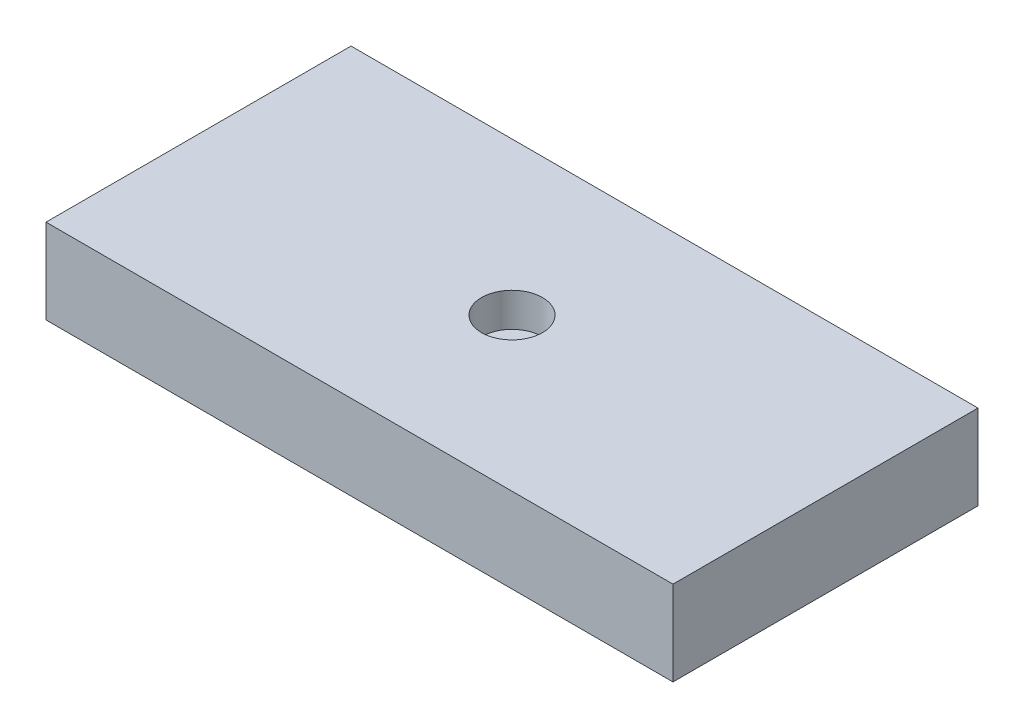
ISO-10303-21;
HEADER;
FILE_DESCRIPTION(('STEP AP214'),'2;1');
FILE_NAME('part.step','',(''),(''),'','','');
FILE_SCHEMA(('AUTOMOTIVE_DESIGN { 1 0 10303 214 1 1 1 1 }'));
ENDSEC;
DATA;
#1=APPLICATION_CONTEXT('core data for automotive mechanical design processes');
#2=APPLICATION_PROTOCOL_DEFINITION('international standard','automotive_design',2000,#1);
#3=PRODUCT_CONTEXT('',#1,'mechanical');
#4=PRODUCT('Part','Part','',(#3));
#5=PRODUCT_RELATED_PRODUCT_CATEGORY('part','',(#4));
#6=PRODUCT_DEFINITION_FORMATION('','',#4);
#7=PRODUCT_DEFINITION_CONTEXT('part definition',#1,'design');
#8=PRODUCT_DEFINITION('design','',#6,#7);
#9=PRODUCT_DEFINITION_SHAPE('','',#8);
#10=(LENGTH_UNIT() NAMED_UNIT(*) SI_UNIT(.MILLI.,.METRE.));
#11=(NAMED_UNIT(*) PLANE_ANGLE_UNIT() SI_UNIT($,.RADIAN.));
#12=(NAMED_UNIT(*) SI_UNIT($,.STERADIAN.) SOLID_ANGLE_UNIT());
#13=UNCERTAINTY_MEASURE_WITH_UNIT(LENGTH_MEASURE(1.E-05),#10,'distance_accuracy_value','');
#14=(GEOMETRIC_REPRESENTATION_CONTEXT(3) GLOBAL_UNCERTAINTY_ASSIGNED_CONTEXT((#13)) GLOBAL_UNIT_ASSIGNED_CONTEXT((#10,
#11,#12)) REPRESENTATION_CONTEXT('',''));
#15=CARTESIAN_POINT('',(0.,0.,0.));
#16=DIRECTION('',(0.,0.,1.));
#17=DIRECTION('',(1.,0.,0.));
#18=AXIS2_PLACEMENT_3D('',#15,#16,#17);
#19=CARTESIAN_POINT('',(18.5,5.,9.));
#20=DIRECTION('',(-1.,0.,0.));
#21=DIRECTION('',(0.,0.,1.));
#22=AXIS2_PLACEMENT_3D('',#19,#20,#21);
#23=PLANE('',#22);
#24=DIRECTION('',(0.,0.,-1.));
#25=VECTOR('',#24,1.);
#26=CARTESIAN_POINT('',(18.5,0.,9.));
#27=LINE('',#26,#25);
#28=CARTESIAN_POINT('',(18.5,0.,9.));
#29=VERTEX_POINT('',#28);
#30=CARTESIAN_POINT('',(18.5,0.,-9.));
#31=VERTEX_POINT('',#30);
#32=EDGE_CURVE('E96',#29,#31,#27,.T.);
#33=ORIENTED_EDGE('',*,*,#32,.T.);
#34=DIRECTION('',(0.,-1.,0.));
#35=VECTOR('',#34,1.);
#36=CARTESIAN_POINT('',(18.5,5.,-9.));
#37=LINE('',#36,#35);
#38=CARTESIAN_POINT('',(18.5,5.,-9.));
#39=VERTEX_POINT('',#38);
#40=EDGE_CURVE('E11',#39,#31,#37,.T.);
#41=ORIENTED_EDGE('',*,*,#40,.F.);
#42=DIRECTION('',(0.,0.,-1.));
#43=VECTOR('',#42,1.);
#44=CARTESIAN_POINT('',(18.5,5.,9.));
#45=LINE('',#44,#43);
#46=CARTESIAN_POINT('',(18.5,5.,9.));
#47=VERTEX_POINT('',#46);
#48=EDGE_CURVE('E84',#47,#39,#45,.T.);
#49=ORIENTED_EDGE('',*,*,#48,.F.);
#50=DIRECTION('',(0.,-1.,0.));
#51=VECTOR('',#50,1.);
#52=CARTESIAN_POINT('',(18.5,5.,9.));
#53=LINE('',#52,#51);
#54=EDGE_CURVE('E92',#47,#29,#53,.T.);
#55=ORIENTED_EDGE('',*,*,#54,.T.);
#56=EDGE_LOOP('',(#33,#41,#49,#55));
#57=FACE_BOUND('',#56,.T.);
#58=ADVANCED_FACE('F33',(#57),#23,.F.);
#59=CARTESIAN_POINT('',(-18.5,5.,-9.));
#60=DIRECTION('',(0.,0.,1.));
#61=DIRECTION('',(1.,0.,0.));
#62=AXIS2_PLACEMENT_3D('',#59,#60,#61);
#63=PLANE('',#62);
#64=DIRECTION('',(-1.,0.,0.));
#65=VECTOR('',#64,1.);
#66=CARTESIAN_POINT('',(-18.5,0.,-9.));
#67=LINE('',#66,#65);
#68=CARTESIAN_POINT('',(-18.5,0.,-9.));
#69=VERTEX_POINT('',#68);
#70=EDGE_CURVE('E88',#31,#69,#67,.T.);
#71=ORIENTED_EDGE('',*,*,#70,.T.);
#72=DIRECTION('',(0.,-1.,0.));
#73=VECTOR('',#72,1.);
#74=CARTESIAN_POINT('',(-18.5,5.,-9.));
#75=LINE('',#74,#73);
#76=CARTESIAN_POINT('',(-18.5,5.,-9.));
#77=VERTEX_POINT('',#76);
#78=EDGE_CURVE('E41',#77,#69,#75,.T.);
#79=ORIENTED_EDGE('',*,*,#78,.F.);
#80=DIRECTION('',(-1.,0.,0.));
#81=VECTOR('',#80,1.);
#82=CARTESIAN_POINT('',(-18.5,5.,-9.));
#83=LINE('',#82,#81);
#84=EDGE_CURVE('E79',#39,#77,#83,.T.);
#85=ORIENTED_EDGE('',*,*,#84,.F.);
#86=ORIENTED_EDGE('',*,*,#40,.T.);
#87=EDGE_LOOP('',(#71,#79,#85,#86));
#88=FACE_BOUND('',#87,.T.);
#89=ADVANCED_FACE('F87',(#88),#63,.F.);
#90=CARTESIAN_POINT('',(-18.5,5.,9.));
#91=DIRECTION('',(1.,0.,0.));
#92=DIRECTION('',(0.,0.,-1.));
#93=AXIS2_PLACEMENT_3D('',#90,#91,#92);
#94=PLANE('',#93);
#95=DIRECTION('',(0.,0.,1.));
#96=VECTOR('',#95,1.);
#97=CARTESIAN_POINT('',(-18.5,0.,9.));
#98=LINE('',#97,#96);
#99=CARTESIAN_POINT('',(-18.5,0.,9.));
#100=VERTEX_POINT('',#99);
#101=EDGE_CURVE('E66',#69,#100,#98,.T.);
#102=ORIENTED_EDGE('',*,*,#101,.T.);
#103=DIRECTION('',(0.,-1.,0.));
#104=VECTOR('',#103,1.);
#105=CARTESIAN_POINT('',(-18.5,5.,9.));
#106=LINE('',#105,#104);
#107=CARTESIAN_POINT('',(-18.5,5.,9.));
#108=VERTEX_POINT('',#107);
#109=EDGE_CURVE('E89',#108,#100,#106,.T.);
#110=ORIENTED_EDGE('',*,*,#109,.F.);
#111=DIRECTION('',(0.,0.,1.));
#112=VECTOR('',#111,1.);
#113=CARTESIAN_POINT('',(-18.5,5.,9.));
#114=LINE('',#113,#112);
#115=EDGE_CURVE('E82',#77,#108,#114,.T.);
#116=ORIENTED_EDGE('',*,*,#115,.F.);
#117=ORIENTED_EDGE('',*,*,#78,.T.);
#118=EDGE_LOOP('',(#102,#110,#116,#117));
#119=FACE_BOUND('',#118,.T.);
#120=ADVANCED_FACE('F90',(#119),#94,.F.);
#121=CARTESIAN_POINT('',(-18.5,5.,9.));
#122=DIRECTION('',(0.,0.,-1.));
#123=DIRECTION('',(-1.,0.,0.));
#124=AXIS2_PLACEMENT_3D('',#121,#122,#123);
#125=PLANE('',#124);
#126=DIRECTION('',(1.,0.,0.));
#127=VECTOR('',#126,1.);
#128=CARTESIAN_POINT('',(-18.5,0.,9.));
#129=LINE('',#128,#127);
#130=EDGE_CURVE('E72',#100,#29,#129,.T.);
#131=ORIENTED_EDGE('',*,*,#130,.T.);
#132=ORIENTED_EDGE('',*,*,#54,.F.);
#133=DIRECTION('',(1.,0.,0.));
#134=VECTOR('',#133,1.);
#135=CARTESIAN_POINT('',(-18.5,5.,9.));
#136=LINE('',#135,#134);
#137=EDGE_CURVE('E49',#108,#47,#136,.T.);
#138=ORIENTED_EDGE('',*,*,#137,.F.);
#139=ORIENTED_EDGE('',*,*,#109,.T.);
#140=EDGE_LOOP('',(#131,#132,#138,#139));
#141=FACE_BOUND('',#140,.T.);
#142=ADVANCED_FACE('F104',(#141),#125,.F.);
#143=CARTESIAN_POINT('',(0.,5.,0.));
#144=DIRECTION('',(0.,-1.,0.));
#145=DIRECTION('',(0.,0.,-1.));
#146=AXIS2_PLACEMENT_3D('',#143,#144,#145);
#147=PLANE('',#146);
#148=CARTESIAN_POINT('',(0.,5.,0.));
#149=DIRECTION('',(0.,1.,0.));
#150=DIRECTION('',(0.,0.,1.));
#151=AXIS2_PLACEMENT_3D('',#148,#149,#150);
#152=CIRCLE('',#151,1.7967503166636);
#153=CARTESIAN_POINT('',(0.,5.,1.7967503166636));
#154=VERTEX_POINT('',#153);
#155=EDGE_CURVE('E110',#154,#154,#152,.T.);
#156=ORIENTED_EDGE('',*,*,#155,.F.);
#157=EDGE_LOOP('',(#156));
#158=FACE_BOUND('',#157,.T.);
#159=ORIENTED_EDGE('',*,*,#48,.T.);
#160=ORIENTED_EDGE('',*,*,#84,.T.);
#161=ORIENTED_EDGE('',*,*,#115,.T.);
#162=ORIENTED_EDGE('',*,*,#137,.T.);
#163=EDGE_LOOP('',(#159,#160,#161,#162));
#164=FACE_BOUND('',#163,.T.);
#165=ADVANCED_FACE('F80',(#158,#164),#147,.F.);
#166=CARTESIAN_POINT('',(0.,0.,0.));
#167=DIRECTION('',(0.,-1.,0.));
#168=DIRECTION('',(0.,0.,-1.));
#169=AXIS2_PLACEMENT_3D('',#166,#167,#168);
#170=PLANE('',#169);
#171=ORIENTED_EDGE('',*,*,#32,.F.);
#172=ORIENTED_EDGE('',*,*,#130,.F.);
#173=ORIENTED_EDGE('',*,*,#101,.F.);
#174=ORIENTED_EDGE('',*,*,#70,.F.);
#175=EDGE_LOOP('',(#171,#172,#173,#174));
#176=FACE_BOUND('',#175,.T.);
#177=ADVANCED_FACE('F107',(#176),#170,.T.);
#178=CARTESIAN_POINT('',(0.,3.,0.));
#179=DIRECTION('',(0.,1.,0.));
#180=DIRECTION('',(0.,0.,1.));
#181=AXIS2_PLACEMENT_3D('',#178,#179,#180);
#182=CYLINDRICAL_SURFACE('',#181,1.7967503166636);
#183=CARTESIAN_POINT('',(0.,3.,0.));
#184=DIRECTION('',(0.,1.,0.));
#185=DIRECTION('',(0.,0.,1.));
#186=AXIS2_PLACEMENT_3D('',#183,#184,#185);
#187=CIRCLE('',#186,1.7967503166636);
#188=CARTESIAN_POINT('',(0.,3.,1.7967503166636));
#189=VERTEX_POINT('',#188);
#190=EDGE_CURVE('E99',#189,#189,#187,.T.);
#191=ORIENTED_EDGE('',*,*,#190,.F.);
#192=EDGE_LOOP('',(#191));
#193=FACE_BOUND('',#192,.T.);
#194=ORIENTED_EDGE('',*,*,#155,.T.);
#195=EDGE_LOOP('',(#194));
#196=FACE_BOUND('',#195,.T.);
#197=ADVANCED_FACE('F118',(#193,#196),#182,.F.);
#198=CARTESIAN_POINT('',(0.,3.,0.));
#199=DIRECTION('',(0.,1.,0.));
#200=DIRECTION('',(0.,0.,1.));
#201=AXIS2_PLACEMENT_3D('',#198,#199,#200);
#202=PLANE('',#201);
#203=ORIENTED_EDGE('',*,*,#190,.T.);
#204=EDGE_LOOP('',(#203));
#205=FACE_BOUND('',#204,.T.);
#206=ADVANCED_FACE('F116',(#205),#202,.T.);
#207=CLOSED_SHELL('',(#58,#89,#120,#142,#165,#177,#197,#206));
#208=MANIFOLD_SOLID_BREP('B2',#207);
#209=ADVANCED_BREP_SHAPE_REPRESENTATION('',(#18,#208),#14);
#210=SHAPE_DEFINITION_REPRESENTATION(#9,#209);
ENDSEC;
END-ISO-10303-21;
